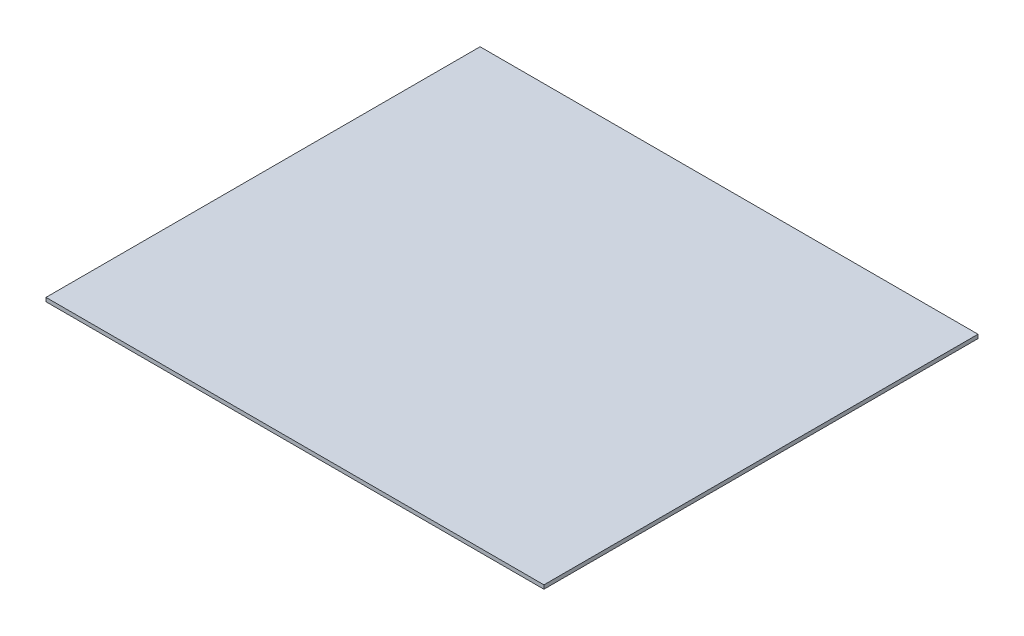
ISO-10303-21;
HEADER;
FILE_DESCRIPTION(('STEP AP214'),'2;1');
FILE_NAME('part.step','',(''),(''),'','','');
FILE_SCHEMA(('AUTOMOTIVE_DESIGN { 1 0 10303 214 1 1 1 1 }'));
ENDSEC;
DATA;
#1=APPLICATION_CONTEXT('core data for automotive mechanical design processes');
#2=APPLICATION_PROTOCOL_DEFINITION('international standard','automotive_design',2000,#1);
#3=PRODUCT_CONTEXT('',#1,'mechanical');
#4=PRODUCT('Part','Part','',(#3));
#5=PRODUCT_RELATED_PRODUCT_CATEGORY('part','',(#4));
#6=PRODUCT_DEFINITION_FORMATION('','',#4);
#7=PRODUCT_DEFINITION_CONTEXT('part definition',#1,'design');
#8=PRODUCT_DEFINITION('design','',#6,#7);
#9=PRODUCT_DEFINITION_SHAPE('','',#8);
#10=(LENGTH_UNIT() NAMED_UNIT(*) SI_UNIT(.MILLI.,.METRE.));
#11=(NAMED_UNIT(*) PLANE_ANGLE_UNIT() SI_UNIT($,.RADIAN.));
#12=(NAMED_UNIT(*) SI_UNIT($,.STERADIAN.) SOLID_ANGLE_UNIT());
#13=UNCERTAINTY_MEASURE_WITH_UNIT(LENGTH_MEASURE(1.E-05),#10,'distance_accuracy_value','');
#14=(GEOMETRIC_REPRESENTATION_CONTEXT(3) GLOBAL_UNCERTAINTY_ASSIGNED_CONTEXT((#13)) GLOBAL_UNIT_ASSIGNED_CONTEXT((#10,
#11,#12)) REPRESENTATION_CONTEXT('',''));
#15=CARTESIAN_POINT('',(0.,0.,0.));
#16=DIRECTION('',(0.,0.,1.));
#17=DIRECTION('',(1.,0.,0.));
#18=AXIS2_PLACEMENT_3D('',#15,#16,#17);
#19=CARTESIAN_POINT('',(0.,3.,0.));
#20=DIRECTION('',(1.,0.,0.));
#21=DIRECTION('',(0.,0.,-1.));
#22=AXIS2_PLACEMENT_3D('',#19,#20,#21);
#23=PLANE('',#22);
#24=DIRECTION('',(0.,0.,1.));
#25=VECTOR('',#24,1.);
#26=CARTESIAN_POINT('',(0.,0.,0.));
#27=LINE('',#26,#25);
#28=CARTESIAN_POINT('',(0.,0.,0.));
#29=VERTEX_POINT('',#28);
#30=CARTESIAN_POINT('',(0.,0.,340.));
#31=VERTEX_POINT('',#30);
#32=EDGE_CURVE('E104',#29,#31,#27,.T.);
#33=ORIENTED_EDGE('',*,*,#32,.T.);
#34=DIRECTION('',(0.,-1.,0.));
#35=VECTOR('',#34,1.);
#36=CARTESIAN_POINT('',(0.,3.,340.));
#37=LINE('',#36,#35);
#38=CARTESIAN_POINT('',(0.,3.,340.));
#39=VERTEX_POINT('',#38);
#40=EDGE_CURVE('E11',#39,#31,#37,.T.);
#41=ORIENTED_EDGE('',*,*,#40,.F.);
#42=DIRECTION('',(0.,0.,1.));
#43=VECTOR('',#42,1.);
#44=CARTESIAN_POINT('',(0.,3.,0.));
#45=LINE('',#44,#43);
#46=CARTESIAN_POINT('',(0.,3.,0.));
#47=VERTEX_POINT('',#46);
#48=EDGE_CURVE('E88',#47,#39,#45,.T.);
#49=ORIENTED_EDGE('',*,*,#48,.F.);
#50=DIRECTION('',(0.,-1.,0.));
#51=VECTOR('',#50,1.);
#52=CARTESIAN_POINT('',(0.,3.,0.));
#53=LINE('',#52,#51);
#54=EDGE_CURVE('E100',#47,#29,#53,.T.);
#55=ORIENTED_EDGE('',*,*,#54,.T.);
#56=EDGE_LOOP('',(#33,#41,#49,#55));
#57=FACE_BOUND('',#56,.T.);
#58=ADVANCED_FACE('F37',(#57),#23,.F.);
#59=CARTESIAN_POINT('',(0.,3.,340.));
#60=DIRECTION('',(0.,0.,-1.));
#61=DIRECTION('',(-1.,0.,0.));
#62=AXIS2_PLACEMENT_3D('',#59,#60,#61);
#63=PLANE('',#62);
#64=DIRECTION('',(1.,0.,0.));
#65=VECTOR('',#64,1.);
#66=CARTESIAN_POINT('',(0.,0.,340.));
#67=LINE('',#66,#65);
#68=CARTESIAN_POINT('',(390.,0.,340.));
#69=VERTEX_POINT('',#68);
#70=EDGE_CURVE('E93',#31,#69,#67,.T.);
#71=ORIENTED_EDGE('',*,*,#70,.T.);
#72=DIRECTION('',(0.,-1.,0.));
#73=VECTOR('',#72,1.);
#74=CARTESIAN_POINT('',(390.,3.,340.));
#75=LINE('',#74,#73);
#76=CARTESIAN_POINT('',(390.,3.,340.));
#77=VERTEX_POINT('',#76);
#78=EDGE_CURVE('E45',#77,#69,#75,.T.);
#79=ORIENTED_EDGE('',*,*,#78,.F.);
#80=DIRECTION('',(1.,0.,0.));
#81=VECTOR('',#80,1.);
#82=CARTESIAN_POINT('',(0.,3.,340.));
#83=LINE('',#82,#81);
#84=EDGE_CURVE('E83',#39,#77,#83,.T.);
#85=ORIENTED_EDGE('',*,*,#84,.F.);
#86=ORIENTED_EDGE('',*,*,#40,.T.);
#87=EDGE_LOOP('',(#71,#79,#85,#86));
#88=FACE_BOUND('',#87,.T.);
#89=ADVANCED_FACE('F92',(#88),#63,.F.);
#90=CARTESIAN_POINT('',(390.,3.,0.));
#91=DIRECTION('',(-1.,0.,0.));
#92=DIRECTION('',(0.,0.,1.));
#93=AXIS2_PLACEMENT_3D('',#90,#91,#92);
#94=PLANE('',#93);
#95=DIRECTION('',(0.,0.,-1.));
#96=VECTOR('',#95,1.);
#97=CARTESIAN_POINT('',(390.,0.,0.));
#98=LINE('',#97,#96);
#99=CARTESIAN_POINT('',(390.,0.,0.));
#100=VERTEX_POINT('',#99);
#101=EDGE_CURVE('E70',#69,#100,#98,.T.);
#102=ORIENTED_EDGE('',*,*,#101,.T.);
#103=DIRECTION('',(0.,-1.,0.));
#104=VECTOR('',#103,1.);
#105=CARTESIAN_POINT('',(390.,3.,0.));
#106=LINE('',#105,#104);
#107=CARTESIAN_POINT('',(390.,3.,0.));
#108=VERTEX_POINT('',#107);
#109=EDGE_CURVE('E94',#108,#100,#106,.T.);
#110=ORIENTED_EDGE('',*,*,#109,.F.);
#111=DIRECTION('',(0.,0.,-1.));
#112=VECTOR('',#111,1.);
#113=CARTESIAN_POINT('',(390.,3.,0.));
#114=LINE('',#113,#112);
#115=EDGE_CURVE('E86',#77,#108,#114,.T.);
#116=ORIENTED_EDGE('',*,*,#115,.F.);
#117=ORIENTED_EDGE('',*,*,#78,.T.);
#118=EDGE_LOOP('',(#102,#110,#116,#117));
#119=FACE_BOUND('',#118,.T.);
#120=ADVANCED_FACE('F95',(#119),#94,.F.);
#121=CARTESIAN_POINT('',(0.,3.,0.));
#122=DIRECTION('',(0.,0.,1.));
#123=DIRECTION('',(1.,0.,0.));
#124=AXIS2_PLACEMENT_3D('',#121,#122,#123);
#125=PLANE('',#124);
#126=DIRECTION('',(-1.,0.,0.));
#127=VECTOR('',#126,1.);
#128=CARTESIAN_POINT('',(0.,0.,0.));
#129=LINE('',#128,#127);
#130=EDGE_CURVE('E76',#100,#29,#129,.T.);
#131=ORIENTED_EDGE('',*,*,#130,.T.);
#132=ORIENTED_EDGE('',*,*,#54,.F.);
#133=DIRECTION('',(-1.,0.,0.));
#134=VECTOR('',#133,1.);
#135=CARTESIAN_POINT('',(0.,3.,0.));
#136=LINE('',#135,#134);
#137=EDGE_CURVE('E53',#108,#47,#136,.T.);
#138=ORIENTED_EDGE('',*,*,#137,.F.);
#139=ORIENTED_EDGE('',*,*,#109,.T.);
#140=EDGE_LOOP('',(#131,#132,#138,#139));
#141=FACE_BOUND('',#140,.T.);
#142=ADVANCED_FACE('F114',(#141),#125,.F.);
#143=CARTESIAN_POINT('',(0.,3.,0.));
#144=DIRECTION('',(0.,1.,0.));
#145=DIRECTION('',(0.,0.,1.));
#146=AXIS2_PLACEMENT_3D('',#143,#144,#145);
#147=PLANE('',#146);
#148=ORIENTED_EDGE('',*,*,#48,.T.);
#149=ORIENTED_EDGE('',*,*,#84,.T.);
#150=ORIENTED_EDGE('',*,*,#115,.T.);
#151=ORIENTED_EDGE('',*,*,#137,.T.);
#152=EDGE_LOOP('',(#148,#149,#150,#151));
#153=FACE_BOUND('',#152,.T.);
#154=ADVANCED_FACE('F84',(#153),#147,.T.);
#155=CARTESIAN_POINT('',(0.,0.,0.));
#156=DIRECTION('',(0.,1.,0.));
#157=DIRECTION('',(0.,0.,1.));
#158=AXIS2_PLACEMENT_3D('',#155,#156,#157);
#159=PLANE('',#158);
#160=ORIENTED_EDGE('',*,*,#32,.F.);
#161=ORIENTED_EDGE('',*,*,#130,.F.);
#162=ORIENTED_EDGE('',*,*,#101,.F.);
#163=ORIENTED_EDGE('',*,*,#70,.F.);
#164=EDGE_LOOP('',(#160,#161,#162,#163));
#165=FACE_BOUND('',#164,.T.);
#166=ADVANCED_FACE('F117',(#165),#159,.F.);
#167=CLOSED_SHELL('',(#58,#89,#120,#142,#154,#166));
#168=MANIFOLD_SOLID_BREP('B2',#167);
#169=ADVANCED_BREP_SHAPE_REPRESENTATION('',(#18,#168),#14);
#170=SHAPE_DEFINITION_REPRESENTATION(#9,#169);
ENDSEC;
END-ISO-10303-21;
